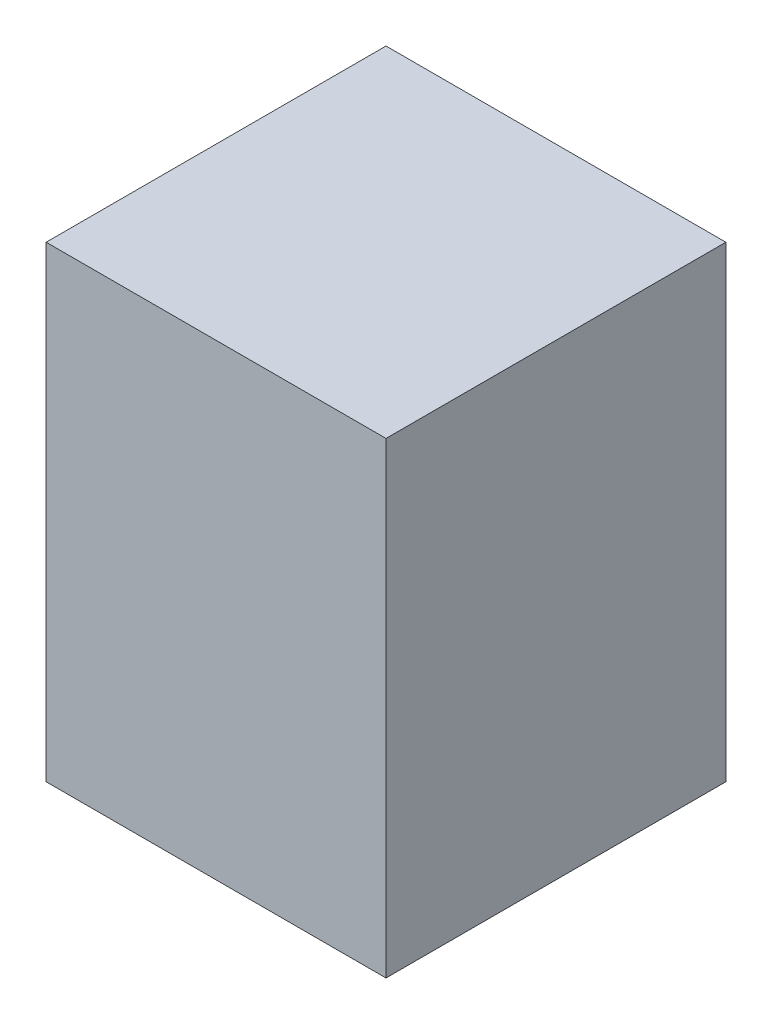
ISO-10303-21;
HEADER;
FILE_DESCRIPTION(('STEP AP214'),'2;1');
FILE_NAME('part.step','',(''),(''),'','','');
FILE_SCHEMA(('AUTOMOTIVE_DESIGN { 1 0 10303 214 1 1 1 1 }'));
ENDSEC;
DATA;
#1=APPLICATION_CONTEXT('core data for automotive mechanical design processes');
#2=APPLICATION_PROTOCOL_DEFINITION('international standard','automotive_design',2000,#1);
#3=PRODUCT_CONTEXT('',#1,'mechanical');
#4=PRODUCT('Part','Part','',(#3));
#5=PRODUCT_RELATED_PRODUCT_CATEGORY('part','',(#4));
#6=PRODUCT_DEFINITION_FORMATION('','',#4);
#7=PRODUCT_DEFINITION_CONTEXT('part definition',#1,'design');
#8=PRODUCT_DEFINITION('design','',#6,#7);
#9=PRODUCT_DEFINITION_SHAPE('','',#8);
#10=(LENGTH_UNIT() NAMED_UNIT(*) SI_UNIT(.MILLI.,.METRE.));
#11=(NAMED_UNIT(*) PLANE_ANGLE_UNIT() SI_UNIT($,.RADIAN.));
#12=(NAMED_UNIT(*) SI_UNIT($,.STERADIAN.) SOLID_ANGLE_UNIT());
#13=UNCERTAINTY_MEASURE_WITH_UNIT(LENGTH_MEASURE(1.E-05),#10,'distance_accuracy_value','');
#14=(GEOMETRIC_REPRESENTATION_CONTEXT(3) GLOBAL_UNCERTAINTY_ASSIGNED_CONTEXT((#13)) GLOBAL_UNIT_ASSIGNED_CONTEXT((#10,
#11,#12)) REPRESENTATION_CONTEXT('',''));
#15=CARTESIAN_POINT('',(0.,0.,0.));
#16=DIRECTION('',(0.,0.,1.));
#17=DIRECTION('',(1.,0.,0.));
#18=AXIS2_PLACEMENT_3D('',#15,#16,#17);
#19=CARTESIAN_POINT('',(0.80000094,-1.10000034,0.));
#20=DIRECTION('',(-1.,0.,0.));
#21=DIRECTION('',(0.,0.,1.));
#22=AXIS2_PLACEMENT_3D('',#19,#20,#21);
#23=PLANE('',#22);
#24=DIRECTION('',(0.,0.,-1.));
#25=VECTOR('',#24,1.);
#26=CARTESIAN_POINT('',(0.80000094,1.10000034,0.));
#27=LINE('',#26,#25);
#28=CARTESIAN_POINT('',(0.80000094,1.10000034,0.));
#29=VERTEX_POINT('',#28);
#30=CARTESIAN_POINT('',(0.80000094,1.10000034,1.59999934));
#31=VERTEX_POINT('',#30);
#32=EDGE_CURVE('E20',#29,#31,#27,.F.);
#33=ORIENTED_EDGE('',*,*,#32,.T.);
#34=DIRECTION('',(0.,1.,0.));
#35=VECTOR('',#34,1.);
#36=CARTESIAN_POINT('',(0.80000094,1.10000034,1.59999934));
#37=LINE('',#36,#35);
#38=CARTESIAN_POINT('',(0.80000094,-1.10000034,1.59999934));
#39=VERTEX_POINT('',#38);
#40=EDGE_CURVE('E55',#31,#39,#37,.F.);
#41=ORIENTED_EDGE('',*,*,#40,.T.);
#42=DIRECTION('',(0.,0.,1.));
#43=VECTOR('',#42,1.);
#44=CARTESIAN_POINT('',(0.80000094,-1.10000034,0.));
#45=LINE('',#44,#43);
#46=CARTESIAN_POINT('',(0.80000094,-1.10000034,0.));
#47=VERTEX_POINT('',#46);
#48=EDGE_CURVE('E74',#39,#47,#45,.F.);
#49=ORIENTED_EDGE('',*,*,#48,.T.);
#50=DIRECTION('',(0.,1.,0.));
#51=VECTOR('',#50,1.);
#52=CARTESIAN_POINT('',(0.80000094,1.10000034,0.));
#53=LINE('',#52,#51);
#54=EDGE_CURVE('E66',#29,#47,#53,.F.);
#55=ORIENTED_EDGE('',*,*,#54,.F.);
#56=EDGE_LOOP('',(#33,#41,#49,#55));
#57=FACE_BOUND('',#56,.T.);
#58=ADVANCED_FACE('F17',(#57),#23,.F.);
#59=CARTESIAN_POINT('',(0.80000094,1.10000034,0.));
#60=DIRECTION('',(0.,-1.,0.));
#61=DIRECTION('',(0.,0.,-1.));
#62=AXIS2_PLACEMENT_3D('',#59,#60,#61);
#63=PLANE('',#62);
#64=DIRECTION('',(0.,0.,-1.));
#65=VECTOR('',#64,1.);
#66=CARTESIAN_POINT('',(-0.7999984,1.10000034,0.));
#67=LINE('',#66,#65);
#68=CARTESIAN_POINT('',(-0.7999984,1.10000034,0.));
#69=VERTEX_POINT('',#68);
#70=CARTESIAN_POINT('',(-0.7999984,1.10000034,1.59999934));
#71=VERTEX_POINT('',#70);
#72=EDGE_CURVE('E72',#69,#71,#67,.F.);
#73=ORIENTED_EDGE('',*,*,#72,.T.);
#74=DIRECTION('',(-1.,0.,0.));
#75=VECTOR('',#74,1.);
#76=CARTESIAN_POINT('',(0.80000094,1.10000034,1.59999934));
#77=LINE('',#76,#75);
#78=EDGE_CURVE('E62',#71,#31,#77,.F.);
#79=ORIENTED_EDGE('',*,*,#78,.T.);
#80=ORIENTED_EDGE('',*,*,#32,.F.);
#81=DIRECTION('',(-1.,0.,0.));
#82=VECTOR('',#81,1.);
#83=CARTESIAN_POINT('',(0.80000094,1.10000034,0.));
#84=LINE('',#83,#82);
#85=EDGE_CURVE('E80',#69,#29,#84,.F.);
#86=ORIENTED_EDGE('',*,*,#85,.F.);
#87=EDGE_LOOP('',(#73,#79,#80,#86));
#88=FACE_BOUND('',#87,.T.);
#89=ADVANCED_FACE('F71',(#88),#63,.F.);
#90=CARTESIAN_POINT('',(0.80000094,1.10000034,1.59999934));
#91=DIRECTION('',(0.,0.,-1.));
#92=DIRECTION('',(-1.,0.,0.));
#93=AXIS2_PLACEMENT_3D('',#90,#91,#92);
#94=PLANE('',#93);
#95=DIRECTION('',(0.,1.,0.));
#96=VECTOR('',#95,1.);
#97=CARTESIAN_POINT('',(-0.7999984,1.10000034,1.59999934));
#98=LINE('',#97,#96);
#99=CARTESIAN_POINT('',(-0.7999984,-1.10000034,1.59999934));
#100=VERTEX_POINT('',#99);
#101=EDGE_CURVE('E83',#71,#100,#98,.F.);
#102=ORIENTED_EDGE('',*,*,#101,.T.);
#103=DIRECTION('',(1.,0.,0.));
#104=VECTOR('',#103,1.);
#105=CARTESIAN_POINT('',(-0.7999984,-1.10000034,1.59999934));
#106=LINE('',#105,#104);
#107=EDGE_CURVE('E64',#100,#39,#106,.T.);
#108=ORIENTED_EDGE('',*,*,#107,.T.);
#109=ORIENTED_EDGE('',*,*,#40,.F.);
#110=ORIENTED_EDGE('',*,*,#78,.F.);
#111=EDGE_LOOP('',(#102,#108,#109,#110));
#112=FACE_BOUND('',#111,.T.);
#113=ADVANCED_FACE('F60',(#112),#94,.F.);
#114=CARTESIAN_POINT('',(-0.7999984,-1.10000034,0.));
#115=DIRECTION('',(0.,1.,0.));
#116=DIRECTION('',(0.,0.,1.));
#117=AXIS2_PLACEMENT_3D('',#114,#115,#116);
#118=PLANE('',#117);
#119=ORIENTED_EDGE('',*,*,#48,.F.);
#120=ORIENTED_EDGE('',*,*,#107,.F.);
#121=DIRECTION('',(0.,0.,-1.));
#122=VECTOR('',#121,1.);
#123=CARTESIAN_POINT('',(-0.7999984,-1.10000034,0.));
#124=LINE('',#123,#122);
#125=CARTESIAN_POINT('',(-0.7999984,-1.10000034,0.));
#126=VERTEX_POINT('',#125);
#127=EDGE_CURVE('E26',#100,#126,#124,.T.);
#128=ORIENTED_EDGE('',*,*,#127,.T.);
#129=DIRECTION('',(-1.,0.,0.));
#130=VECTOR('',#129,1.);
#131=CARTESIAN_POINT('',(0.80000094,-1.10000034,0.));
#132=LINE('',#131,#130);
#133=EDGE_CURVE('E34',#47,#126,#132,.T.);
#134=ORIENTED_EDGE('',*,*,#133,.F.);
#135=EDGE_LOOP('',(#119,#120,#128,#134));
#136=FACE_BOUND('',#135,.T.);
#137=ADVANCED_FACE('F88',(#136),#118,.F.);
#138=CARTESIAN_POINT('',(0.80000094,1.10000034,0.));
#139=DIRECTION('',(0.,0.,-1.));
#140=DIRECTION('',(-1.,0.,0.));
#141=AXIS2_PLACEMENT_3D('',#138,#139,#140);
#142=PLANE('',#141);
#143=DIRECTION('',(0.,1.,0.));
#144=VECTOR('',#143,1.);
#145=CARTESIAN_POINT('',(-0.7999984,1.10000034,0.));
#146=LINE('',#145,#144);
#147=EDGE_CURVE('E11',#126,#69,#146,.T.);
#148=ORIENTED_EDGE('',*,*,#147,.T.);
#149=ORIENTED_EDGE('',*,*,#85,.T.);
#150=ORIENTED_EDGE('',*,*,#54,.T.);
#151=ORIENTED_EDGE('',*,*,#133,.T.);
#152=EDGE_LOOP('',(#148,#149,#150,#151));
#153=FACE_BOUND('',#152,.T.);
#154=ADVANCED_FACE('F91',(#153),#142,.T.);
#155=CARTESIAN_POINT('',(-0.7999984,1.10000034,0.));
#156=DIRECTION('',(1.,0.,0.));
#157=DIRECTION('',(0.,0.,-1.));
#158=AXIS2_PLACEMENT_3D('',#155,#156,#157);
#159=PLANE('',#158);
#160=ORIENTED_EDGE('',*,*,#127,.F.);
#161=ORIENTED_EDGE('',*,*,#101,.F.);
#162=ORIENTED_EDGE('',*,*,#72,.F.);
#163=ORIENTED_EDGE('',*,*,#147,.F.);
#164=EDGE_LOOP('',(#160,#161,#162,#163));
#165=FACE_BOUND('',#164,.T.);
#166=ADVANCED_FACE('F90',(#165),#159,.F.);
#167=CLOSED_SHELL('',(#58,#89,#113,#137,#154,#166));
#168=MANIFOLD_SOLID_BREP('B1',#167);
#169=ADVANCED_BREP_SHAPE_REPRESENTATION('',(#18,#168),#14);
#170=SHAPE_DEFINITION_REPRESENTATION(#9,#169);
ENDSEC;
END-ISO-10303-21;
